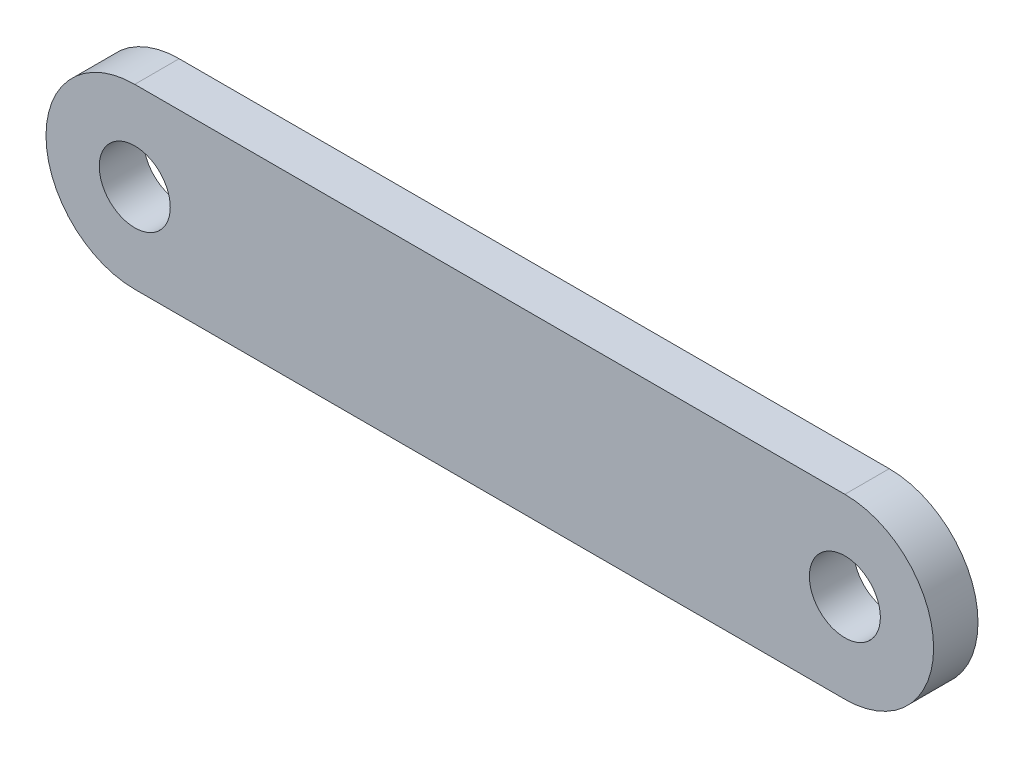
ISO-10303-21;
HEADER;
FILE_DESCRIPTION(('STEP AP214'),'2;1');
FILE_NAME('part.step','',(''),(''),'','','');
FILE_SCHEMA(('AUTOMOTIVE_DESIGN { 1 0 10303 214 1 1 1 1 }'));
ENDSEC;
DATA;
#1=APPLICATION_CONTEXT('core data for automotive mechanical design processes');
#2=APPLICATION_PROTOCOL_DEFINITION('international standard','automotive_design',2000,#1);
#3=PRODUCT_CONTEXT('',#1,'mechanical');
#4=PRODUCT('Part','Part','',(#3));
#5=PRODUCT_RELATED_PRODUCT_CATEGORY('part','',(#4));
#6=PRODUCT_DEFINITION_FORMATION('','',#4);
#7=PRODUCT_DEFINITION_CONTEXT('part definition',#1,'design');
#8=PRODUCT_DEFINITION('design','',#6,#7);
#9=PRODUCT_DEFINITION_SHAPE('','',#8);
#10=(LENGTH_UNIT() NAMED_UNIT(*) SI_UNIT(.MILLI.,.METRE.));
#11=(NAMED_UNIT(*) PLANE_ANGLE_UNIT() SI_UNIT($,.RADIAN.));
#12=(NAMED_UNIT(*) SI_UNIT($,.STERADIAN.) SOLID_ANGLE_UNIT());
#13=UNCERTAINTY_MEASURE_WITH_UNIT(LENGTH_MEASURE(1.E-05),#10,'distance_accuracy_value','');
#14=(GEOMETRIC_REPRESENTATION_CONTEXT(3) GLOBAL_UNCERTAINTY_ASSIGNED_CONTEXT((#13)) GLOBAL_UNIT_ASSIGNED_CONTEXT((#10,
#11,#12)) REPRESENTATION_CONTEXT('',''));
#15=CARTESIAN_POINT('',(0.,0.,0.));
#16=DIRECTION('',(0.,0.,1.));
#17=DIRECTION('',(1.,0.,0.));
#18=AXIS2_PLACEMENT_3D('',#15,#16,#17);
#19=CARTESIAN_POINT('',(16.,0.,1.));
#20=DIRECTION('',(0.,0.,1.));
#21=DIRECTION('',(1.,0.,0.));
#22=AXIS2_PLACEMENT_3D('',#19,#20,#21);
#23=PLANE('',#22);
#24=CARTESIAN_POINT('',(0.,0.,1.));
#25=DIRECTION('',(0.,0.,1.));
#26=DIRECTION('',(1.,0.,0.));
#27=AXIS2_PLACEMENT_3D('',#24,#25,#26);
#28=CIRCLE('',#27,0.8);
#29=CARTESIAN_POINT('',(0.8,0.,1.));
#30=VERTEX_POINT('',#29);
#31=EDGE_CURVE('E100',#30,#30,#28,.T.);
#32=ORIENTED_EDGE('',*,*,#31,.F.);
#33=EDGE_LOOP('',(#32));
#34=FACE_BOUND('',#33,.T.);
#35=CARTESIAN_POINT('',(16.,0.,1.));
#36=DIRECTION('',(0.,0.,1.));
#37=DIRECTION('',(1.,0.,0.));
#38=AXIS2_PLACEMENT_3D('',#35,#36,#37);
#39=CIRCLE('',#38,2.);
#40=CARTESIAN_POINT('',(16.,-2.,1.));
#41=VERTEX_POINT('',#40);
#42=CARTESIAN_POINT('',(16.,2.,1.));
#43=VERTEX_POINT('',#42);
#44=EDGE_CURVE('E85',#41,#43,#39,.T.);
#45=ORIENTED_EDGE('',*,*,#44,.T.);
#46=DIRECTION('',(-1.,0.,0.));
#47=VECTOR('',#46,1.);
#48=CARTESIAN_POINT('',(0.,2.,1.));
#49=LINE('',#48,#47);
#50=CARTESIAN_POINT('',(0.,2.,1.));
#51=VERTEX_POINT('',#50);
#52=EDGE_CURVE('E80',#43,#51,#49,.T.);
#53=ORIENTED_EDGE('',*,*,#52,.T.);
#54=CARTESIAN_POINT('',(0.,0.,1.));
#55=DIRECTION('',(0.,0.,1.));
#56=DIRECTION('',(1.,0.,0.));
#57=AXIS2_PLACEMENT_3D('',#54,#55,#56);
#58=CIRCLE('',#57,2.);
#59=CARTESIAN_POINT('',(0.,-2.,1.));
#60=VERTEX_POINT('',#59);
#61=EDGE_CURVE('E83',#51,#60,#58,.T.);
#62=ORIENTED_EDGE('',*,*,#61,.T.);
#63=DIRECTION('',(1.,0.,0.));
#64=VECTOR('',#63,1.);
#65=CARTESIAN_POINT('',(16.,-2.,1.));
#66=LINE('',#65,#64);
#67=EDGE_CURVE('E50',#60,#41,#66,.T.);
#68=ORIENTED_EDGE('',*,*,#67,.T.);
#69=EDGE_LOOP('',(#45,#53,#62,#68));
#70=FACE_BOUND('',#69,.T.);
#71=CARTESIAN_POINT('',(16.,0.,1.));
#72=DIRECTION('',(0.,0.,1.));
#73=DIRECTION('',(1.,0.,0.));
#74=AXIS2_PLACEMENT_3D('',#71,#72,#73);
#75=CIRCLE('',#74,0.800000000000002);
#76=CARTESIAN_POINT('',(16.8,0.,1.));
#77=VERTEX_POINT('',#76);
#78=EDGE_CURVE('E115',#77,#77,#75,.T.);
#79=ORIENTED_EDGE('',*,*,#78,.F.);
#80=EDGE_LOOP('',(#79));
#81=FACE_BOUND('',#80,.T.);
#82=ADVANCED_FACE('F33',(#34,#70,#81),#23,.T.);
#83=CARTESIAN_POINT('',(16.,0.,0.));
#84=DIRECTION('',(0.,0.,1.));
#85=DIRECTION('',(1.,0.,0.));
#86=AXIS2_PLACEMENT_3D('',#83,#84,#85);
#87=PLANE('',#86);
#88=CARTESIAN_POINT('',(16.,0.,0.));
#89=DIRECTION('',(0.,0.,1.));
#90=DIRECTION('',(1.,0.,0.));
#91=AXIS2_PLACEMENT_3D('',#88,#89,#90);
#92=CIRCLE('',#91,2.);
#93=CARTESIAN_POINT('',(16.,-2.,0.));
#94=VERTEX_POINT('',#93);
#95=CARTESIAN_POINT('',(16.,2.,0.));
#96=VERTEX_POINT('',#95);
#97=EDGE_CURVE('E97',#94,#96,#92,.T.);
#98=ORIENTED_EDGE('',*,*,#97,.F.);
#99=DIRECTION('',(1.,0.,0.));
#100=VECTOR('',#99,1.);
#101=CARTESIAN_POINT('',(16.,-2.,0.));
#102=LINE('',#101,#100);
#103=CARTESIAN_POINT('',(0.,-2.,0.));
#104=VERTEX_POINT('',#103);
#105=EDGE_CURVE('E73',#104,#94,#102,.T.);
#106=ORIENTED_EDGE('',*,*,#105,.F.);
#107=CARTESIAN_POINT('',(0.,0.,0.));
#108=DIRECTION('',(0.,0.,1.));
#109=DIRECTION('',(1.,0.,0.));
#110=AXIS2_PLACEMENT_3D('',#107,#108,#109);
#111=CIRCLE('',#110,2.);
#112=CARTESIAN_POINT('',(0.,2.,0.));
#113=VERTEX_POINT('',#112);
#114=EDGE_CURVE('E67',#113,#104,#111,.T.);
#115=ORIENTED_EDGE('',*,*,#114,.F.);
#116=DIRECTION('',(-1.,0.,0.));
#117=VECTOR('',#116,1.);
#118=CARTESIAN_POINT('',(0.,2.,0.));
#119=LINE('',#118,#117);
#120=EDGE_CURVE('E89',#96,#113,#119,.T.);
#121=ORIENTED_EDGE('',*,*,#120,.F.);
#122=EDGE_LOOP('',(#98,#106,#115,#121));
#123=FACE_BOUND('',#122,.T.);
#124=CARTESIAN_POINT('',(0.,0.,0.));
#125=DIRECTION('',(0.,0.,1.));
#126=DIRECTION('',(1.,0.,0.));
#127=AXIS2_PLACEMENT_3D('',#124,#125,#126);
#128=CIRCLE('',#127,0.8);
#129=CARTESIAN_POINT('',(0.8,0.,0.));
#130=VERTEX_POINT('',#129);
#131=EDGE_CURVE('E112',#130,#130,#128,.T.);
#132=ORIENTED_EDGE('',*,*,#131,.T.);
#133=EDGE_LOOP('',(#132));
#134=FACE_BOUND('',#133,.T.);
#135=CARTESIAN_POINT('',(16.,0.,0.));
#136=DIRECTION('',(0.,0.,1.));
#137=DIRECTION('',(1.,0.,0.));
#138=AXIS2_PLACEMENT_3D('',#135,#136,#137);
#139=CIRCLE('',#138,0.800000000000002);
#140=CARTESIAN_POINT('',(16.8,0.,0.));
#141=VERTEX_POINT('',#140);
#142=EDGE_CURVE('E118',#141,#141,#139,.T.);
#143=ORIENTED_EDGE('',*,*,#142,.T.);
#144=EDGE_LOOP('',(#143));
#145=FACE_BOUND('',#144,.T.);
#146=ADVANCED_FACE('F108',(#123,#134,#145),#87,.F.);
#147=CARTESIAN_POINT('',(16.,0.,1.));
#148=DIRECTION('',(0.,0.,-1.));
#149=DIRECTION('',(-1.,0.,0.));
#150=AXIS2_PLACEMENT_3D('',#147,#148,#149);
#151=CYLINDRICAL_SURFACE('',#150,2.);
#152=ORIENTED_EDGE('',*,*,#97,.T.);
#153=DIRECTION('',(0.,0.,-1.));
#154=VECTOR('',#153,1.);
#155=CARTESIAN_POINT('',(16.,2.,1.));
#156=LINE('',#155,#154);
#157=EDGE_CURVE('E11',#43,#96,#156,.T.);
#158=ORIENTED_EDGE('',*,*,#157,.F.);
#159=ORIENTED_EDGE('',*,*,#44,.F.);
#160=DIRECTION('',(0.,0.,-1.));
#161=VECTOR('',#160,1.);
#162=CARTESIAN_POINT('',(16.,-2.,1.));
#163=LINE('',#162,#161);
#164=EDGE_CURVE('E93',#41,#94,#163,.T.);
#165=ORIENTED_EDGE('',*,*,#164,.T.);
#166=EDGE_LOOP('',(#152,#158,#159,#165));
#167=FACE_BOUND('',#166,.T.);
#168=ADVANCED_FACE('F35',(#167),#151,.T.);
#169=CARTESIAN_POINT('',(0.,2.,1.));
#170=DIRECTION('',(0.,-1.,0.));
#171=DIRECTION('',(1.,0.,0.));
#172=AXIS2_PLACEMENT_3D('',#169,#170,#171);
#173=PLANE('',#172);
#174=ORIENTED_EDGE('',*,*,#120,.T.);
#175=DIRECTION('',(0.,0.,-1.));
#176=VECTOR('',#175,1.);
#177=CARTESIAN_POINT('',(0.,2.,1.));
#178=LINE('',#177,#176);
#179=EDGE_CURVE('E42',#51,#113,#178,.T.);
#180=ORIENTED_EDGE('',*,*,#179,.F.);
#181=ORIENTED_EDGE('',*,*,#52,.F.);
#182=ORIENTED_EDGE('',*,*,#157,.T.);
#183=EDGE_LOOP('',(#174,#180,#181,#182));
#184=FACE_BOUND('',#183,.T.);
#185=ADVANCED_FACE('F88',(#184),#173,.F.);
#186=CARTESIAN_POINT('',(0.,0.,1.));
#187=DIRECTION('',(0.,0.,-1.));
#188=DIRECTION('',(-1.,0.,0.));
#189=AXIS2_PLACEMENT_3D('',#186,#187,#188);
#190=CYLINDRICAL_SURFACE('',#189,2.);
#191=ORIENTED_EDGE('',*,*,#114,.T.);
#192=DIRECTION('',(0.,0.,-1.));
#193=VECTOR('',#192,1.);
#194=CARTESIAN_POINT('',(0.,-2.,1.));
#195=LINE('',#194,#193);
#196=EDGE_CURVE('E90',#60,#104,#195,.T.);
#197=ORIENTED_EDGE('',*,*,#196,.F.);
#198=ORIENTED_EDGE('',*,*,#61,.F.);
#199=ORIENTED_EDGE('',*,*,#179,.T.);
#200=EDGE_LOOP('',(#191,#197,#198,#199));
#201=FACE_BOUND('',#200,.T.);
#202=ADVANCED_FACE('F91',(#201),#190,.T.);
#203=CARTESIAN_POINT('',(16.,-2.,1.));
#204=DIRECTION('',(0.,1.,0.));
#205=DIRECTION('',(-1.,0.,0.));
#206=AXIS2_PLACEMENT_3D('',#203,#204,#205);
#207=PLANE('',#206);
#208=ORIENTED_EDGE('',*,*,#105,.T.);
#209=ORIENTED_EDGE('',*,*,#164,.F.);
#210=ORIENTED_EDGE('',*,*,#67,.F.);
#211=ORIENTED_EDGE('',*,*,#196,.T.);
#212=EDGE_LOOP('',(#208,#209,#210,#211));
#213=FACE_BOUND('',#212,.T.);
#214=ADVANCED_FACE('F105',(#213),#207,.F.);
#215=CARTESIAN_POINT('',(0.,0.,1.));
#216=DIRECTION('',(0.,0.,-1.));
#217=DIRECTION('',(-1.,0.,0.));
#218=AXIS2_PLACEMENT_3D('',#215,#216,#217);
#219=CYLINDRICAL_SURFACE('',#218,0.8);
#220=ORIENTED_EDGE('',*,*,#31,.T.);
#221=EDGE_LOOP('',(#220));
#222=FACE_BOUND('',#221,.T.);
#223=ORIENTED_EDGE('',*,*,#131,.F.);
#224=EDGE_LOOP('',(#223));
#225=FACE_BOUND('',#224,.T.);
#226=ADVANCED_FACE('F135',(#222,#225),#219,.F.);
#227=CARTESIAN_POINT('',(16.,0.,1.));
#228=DIRECTION('',(0.,0.,-1.));
#229=DIRECTION('',(-1.,0.,0.));
#230=AXIS2_PLACEMENT_3D('',#227,#228,#229);
#231=CYLINDRICAL_SURFACE('',#230,0.800000000000002);
#232=ORIENTED_EDGE('',*,*,#78,.T.);
#233=EDGE_LOOP('',(#232));
#234=FACE_BOUND('',#233,.T.);
#235=ORIENTED_EDGE('',*,*,#142,.F.);
#236=EDGE_LOOP('',(#235));
#237=FACE_BOUND('',#236,.T.);
#238=ADVANCED_FACE('F124',(#234,#237),#231,.F.);
#239=CLOSED_SHELL('',(#82,#146,#168,#185,#202,#214,#226,#238));
#240=MANIFOLD_SOLID_BREP('B2',#239);
#241=ADVANCED_BREP_SHAPE_REPRESENTATION('',(#18,#240),#14);
#242=SHAPE_DEFINITION_REPRESENTATION(#9,#241);
ENDSEC;
END-ISO-10303-21;
